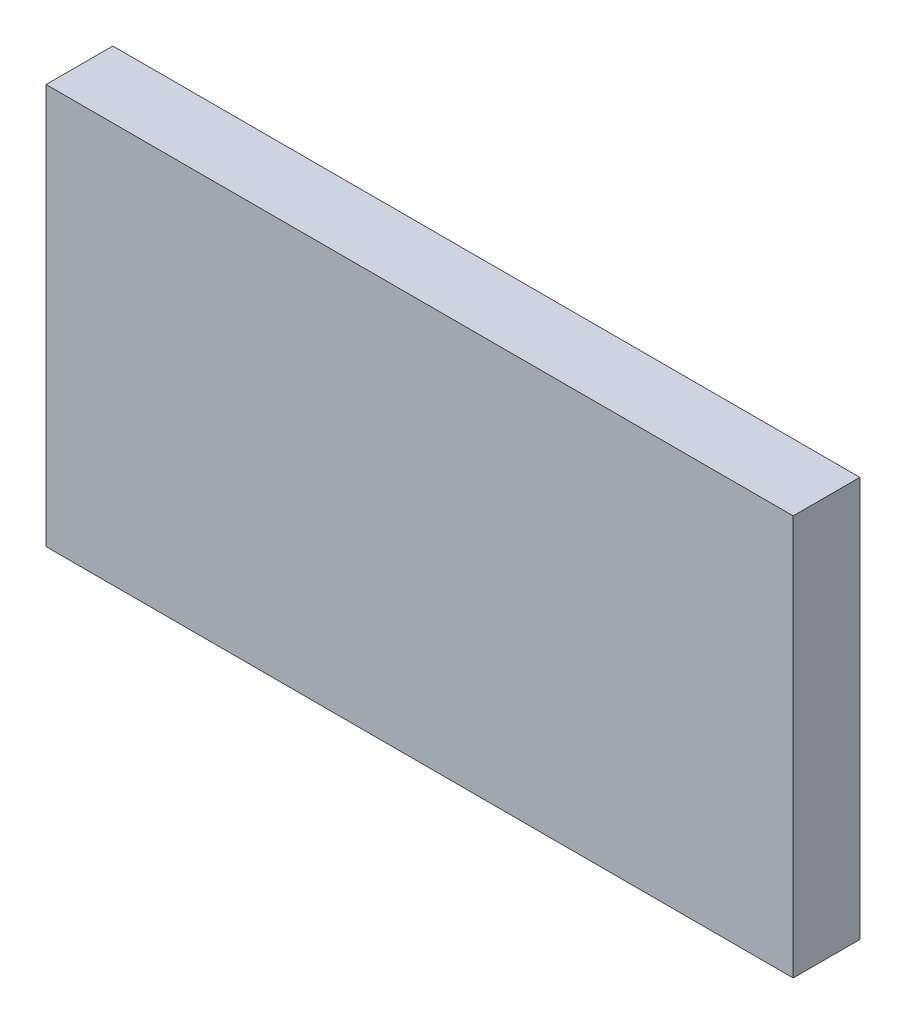
ISO-10303-21;
HEADER;
FILE_DESCRIPTION(('STEP AP214'),'2;1');
FILE_NAME('part.step','',(''),(''),'','','');
FILE_SCHEMA(('AUTOMOTIVE_DESIGN { 1 0 10303 214 1 1 1 1 }'));
ENDSEC;
DATA;
#1=APPLICATION_CONTEXT('core data for automotive mechanical design processes');
#2=APPLICATION_PROTOCOL_DEFINITION('international standard','automotive_design',2000,#1);
#3=PRODUCT_CONTEXT('',#1,'mechanical');
#4=PRODUCT('Part','Part','',(#3));
#5=PRODUCT_RELATED_PRODUCT_CATEGORY('part','',(#4));
#6=PRODUCT_DEFINITION_FORMATION('','',#4);
#7=PRODUCT_DEFINITION_CONTEXT('part definition',#1,'design');
#8=PRODUCT_DEFINITION('design','',#6,#7);
#9=PRODUCT_DEFINITION_SHAPE('','',#8);
#10=(LENGTH_UNIT() NAMED_UNIT(*) SI_UNIT(.MILLI.,.METRE.));
#11=(NAMED_UNIT(*) PLANE_ANGLE_UNIT() SI_UNIT($,.RADIAN.));
#12=(NAMED_UNIT(*) SI_UNIT($,.STERADIAN.) SOLID_ANGLE_UNIT());
#13=UNCERTAINTY_MEASURE_WITH_UNIT(LENGTH_MEASURE(1.E-05),#10,'distance_accuracy_value','');
#14=(GEOMETRIC_REPRESENTATION_CONTEXT(3) GLOBAL_UNCERTAINTY_ASSIGNED_CONTEXT((#13)) GLOBAL_UNIT_ASSIGNED_CONTEXT((#10,
#11,#12)) REPRESENTATION_CONTEXT('',''));
#15=CARTESIAN_POINT('',(0.,0.,0.));
#16=DIRECTION('',(0.,0.,1.));
#17=DIRECTION('',(1.,0.,0.));
#18=AXIS2_PLACEMENT_3D('',#15,#16,#17);
#19=CARTESIAN_POINT('',(-0.513736998032061,-0.649602719280402,0.0826433070866142));
#20=DIRECTION('',(0.,0.,1.));
#21=DIRECTION('',(0.,-1.,0.));
#22=AXIS2_PLACEMENT_3D('',#19,#20,#21);
#23=PLANE('',#22);
#24=DIRECTION('',(0.,1.,0.));
#25=VECTOR('',#24,1.);
#26=CARTESIAN_POINT('',(-0.587815738189541,-0.649602719280402,0.0826433070866142));
#27=LINE('',#26,#25);
#28=CARTESIAN_POINT('',(-0.587815738189541,-0.647712955500875,0.0826433070866142));
#29=VERTEX_POINT('',#28);
#30=CARTESIAN_POINT('',(-0.587815738189541,-0.609917679910324,0.0826433070866142));
#31=VERTEX_POINT('',#30);
#32=EDGE_CURVE('E71',#29,#31,#27,.T.);
#33=ORIENTED_EDGE('',*,*,#32,.T.);
#34=DIRECTION('',(1.,0.,0.));
#35=VECTOR('',#34,1.);
#36=CARTESIAN_POINT('',(-0.513736998032061,-0.609917679910324,0.0826433070866142));
#37=LINE('',#36,#35);
#38=CARTESIAN_POINT('',(-0.517264557087179,-0.609917679910324,0.0826433070866142));
#39=VERTEX_POINT('',#38);
#40=EDGE_CURVE('E54',#39,#31,#37,.F.);
#41=ORIENTED_EDGE('',*,*,#40,.F.);
#42=DIRECTION('',(0.,1.,0.));
#43=VECTOR('',#42,1.);
#44=CARTESIAN_POINT('',(-0.517264557087179,-0.649602719280402,0.0826433070866142));
#45=LINE('',#44,#43);
#46=CARTESIAN_POINT('',(-0.517264557087179,-0.647712955500875,0.0826433070866142));
#47=VERTEX_POINT('',#46);
#48=EDGE_CURVE('E20',#47,#39,#45,.T.);
#49=ORIENTED_EDGE('',*,*,#48,.F.);
#50=DIRECTION('',(1.,0.,0.));
#51=VECTOR('',#50,1.);
#52=CARTESIAN_POINT('',(-0.591343297244659,-0.647712955500875,0.0826433070866142));
#53=LINE('',#52,#51);
#54=EDGE_CURVE('E81',#29,#47,#53,.T.);
#55=ORIENTED_EDGE('',*,*,#54,.F.);
#56=EDGE_LOOP('',(#33,#41,#49,#55));
#57=FACE_BOUND('',#56,.T.);
#58=ADVANCED_FACE('F17',(#57),#23,.F.);
#59=CARTESIAN_POINT('',(-0.517264557087179,-0.649602719280402,0.0823283464566929));
#60=DIRECTION('',(-1.,0.,0.));
#61=DIRECTION('',(0.,0.,1.));
#62=AXIS2_PLACEMENT_3D('',#59,#60,#61);
#63=PLANE('',#62);
#64=DIRECTION('',(0.,0.,1.));
#65=VECTOR('',#64,1.);
#66=CARTESIAN_POINT('',(-0.517264557087179,-0.647712955500875,0.0823283464566929));
#67=LINE('',#66,#65);
#68=CARTESIAN_POINT('',(-0.517264557087179,-0.647712955500875,0.0889425196850394));
#69=VERTEX_POINT('',#68);
#70=EDGE_CURVE('E64',#47,#69,#67,.T.);
#71=ORIENTED_EDGE('',*,*,#70,.F.);
#72=ORIENTED_EDGE('',*,*,#48,.T.);
#73=DIRECTION('',(0.,0.,-1.));
#74=VECTOR('',#73,1.);
#75=CARTESIAN_POINT('',(-0.517264557087179,-0.609917679910324,0.0823283464566929));
#76=LINE('',#75,#74);
#77=CARTESIAN_POINT('',(-0.517264557087179,-0.609917679910324,0.0889425196850394));
#78=VERTEX_POINT('',#77);
#79=EDGE_CURVE('E62',#78,#39,#76,.T.);
#80=ORIENTED_EDGE('',*,*,#79,.F.);
#81=DIRECTION('',(0.,1.,0.));
#82=VECTOR('',#81,1.);
#83=CARTESIAN_POINT('',(-0.517264557087179,-0.649602719280402,0.0889425196850394));
#84=LINE('',#83,#82);
#85=EDGE_CURVE('E83',#69,#78,#84,.T.);
#86=ORIENTED_EDGE('',*,*,#85,.F.);
#87=EDGE_LOOP('',(#71,#72,#80,#86));
#88=FACE_BOUND('',#87,.T.);
#89=ADVANCED_FACE('F60',(#88),#63,.F.);
#90=CARTESIAN_POINT('',(-0.513736998032061,-0.609917679910324,0.0823283464566929));
#91=DIRECTION('',(0.,-1.,0.));
#92=DIRECTION('',(0.,0.,-1.));
#93=AXIS2_PLACEMENT_3D('',#90,#91,#92);
#94=PLANE('',#93);
#95=DIRECTION('',(0.,0.,1.));
#96=VECTOR('',#95,1.);
#97=CARTESIAN_POINT('',(-0.587815738189541,-0.609917679910324,0.0823283464566929));
#98=LINE('',#97,#96);
#99=CARTESIAN_POINT('',(-0.587815738189541,-0.609917679910324,0.0889425196850394));
#100=VERTEX_POINT('',#99);
#101=EDGE_CURVE('E73',#31,#100,#98,.T.);
#102=ORIENTED_EDGE('',*,*,#101,.T.);
#103=DIRECTION('',(1.,0.,0.));
#104=VECTOR('',#103,1.);
#105=CARTESIAN_POINT('',(-0.513736998032061,-0.609917679910324,0.0889425196850394));
#106=LINE('',#105,#104);
#107=EDGE_CURVE('E69',#78,#100,#106,.F.);
#108=ORIENTED_EDGE('',*,*,#107,.F.);
#109=ORIENTED_EDGE('',*,*,#79,.T.);
#110=ORIENTED_EDGE('',*,*,#40,.T.);
#111=EDGE_LOOP('',(#102,#108,#109,#110));
#112=FACE_BOUND('',#111,.T.);
#113=ADVANCED_FACE('F68',(#112),#94,.F.);
#114=CARTESIAN_POINT('',(-0.587815738189541,-0.649602719280402,0.0823283464566929));
#115=DIRECTION('',(-1.,0.,0.));
#116=DIRECTION('',(0.,0.,1.));
#117=AXIS2_PLACEMENT_3D('',#114,#115,#116);
#118=PLANE('',#117);
#119=ORIENTED_EDGE('',*,*,#32,.F.);
#120=DIRECTION('',(0.,0.,1.));
#121=VECTOR('',#120,1.);
#122=CARTESIAN_POINT('',(-0.587815738189541,-0.647712955500875,0.0823283464566929));
#123=LINE('',#122,#121);
#124=CARTESIAN_POINT('',(-0.587815738189541,-0.647712955500875,0.0889425196850394));
#125=VERTEX_POINT('',#124);
#126=EDGE_CURVE('E78',#125,#29,#123,.F.);
#127=ORIENTED_EDGE('',*,*,#126,.F.);
#128=DIRECTION('',(0.,1.,0.));
#129=VECTOR('',#128,1.);
#130=CARTESIAN_POINT('',(-0.587815738189541,-0.649602719280402,0.0889425196850394));
#131=LINE('',#130,#129);
#132=EDGE_CURVE('E26',#100,#125,#131,.F.);
#133=ORIENTED_EDGE('',*,*,#132,.F.);
#134=ORIENTED_EDGE('',*,*,#101,.F.);
#135=EDGE_LOOP('',(#119,#127,#133,#134));
#136=FACE_BOUND('',#135,.T.);
#137=ADVANCED_FACE('F88',(#136),#118,.T.);
#138=CARTESIAN_POINT('',(-0.591343297244659,-0.647712955500875,0.0823283464566929));
#139=DIRECTION('',(0.,1.,0.));
#140=DIRECTION('',(0.,0.,1.));
#141=AXIS2_PLACEMENT_3D('',#138,#139,#140);
#142=PLANE('',#141);
#143=ORIENTED_EDGE('',*,*,#126,.T.);
#144=ORIENTED_EDGE('',*,*,#54,.T.);
#145=ORIENTED_EDGE('',*,*,#70,.T.);
#146=DIRECTION('',(1.,0.,0.));
#147=VECTOR('',#146,1.);
#148=CARTESIAN_POINT('',(-0.513736998032061,-0.647712955500875,0.0889425196850394));
#149=LINE('',#148,#147);
#150=EDGE_CURVE('E11',#125,#69,#149,.T.);
#151=ORIENTED_EDGE('',*,*,#150,.F.);
#152=EDGE_LOOP('',(#143,#144,#145,#151));
#153=FACE_BOUND('',#152,.T.);
#154=ADVANCED_FACE('F91',(#153),#142,.F.);
#155=CARTESIAN_POINT('',(-0.513736998032061,-0.649602719280402,0.0889425196850394));
#156=DIRECTION('',(0.,0.,-1.));
#157=DIRECTION('',(0.,1.,0.));
#158=AXIS2_PLACEMENT_3D('',#155,#156,#157);
#159=PLANE('',#158);
#160=ORIENTED_EDGE('',*,*,#132,.T.);
#161=ORIENTED_EDGE('',*,*,#150,.T.);
#162=ORIENTED_EDGE('',*,*,#85,.T.);
#163=ORIENTED_EDGE('',*,*,#107,.T.);
#164=EDGE_LOOP('',(#160,#161,#162,#163));
#165=FACE_BOUND('',#164,.T.);
#166=ADVANCED_FACE('F86',(#165),#159,.F.);
#167=CLOSED_SHELL('',(#58,#89,#113,#137,#154,#166));
#168=MANIFOLD_SOLID_BREP('B1',#167);
#169=ADVANCED_BREP_SHAPE_REPRESENTATION('',(#18,#168),#14);
#170=SHAPE_DEFINITION_REPRESENTATION(#9,#169);
ENDSEC;
END-ISO-10303-21;
